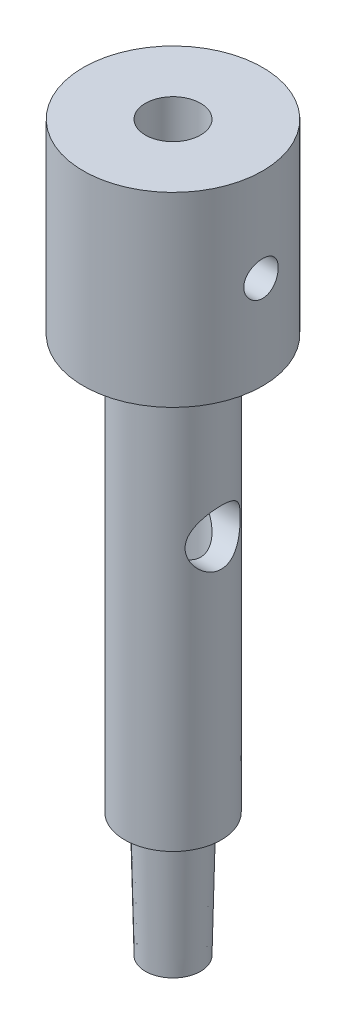
ISO-10303-21;
HEADER;
FILE_DESCRIPTION(('STEP AP214'),'2;1');
FILE_NAME('part.step','',(''),(''),'','','');
FILE_SCHEMA(('AUTOMOTIVE_DESIGN { 1 0 10303 214 1 1 1 1 }'));
ENDSEC;
DATA;
#1=APPLICATION_CONTEXT('core data for automotive mechanical design processes');
#2=APPLICATION_PROTOCOL_DEFINITION('international standard','automotive_design',2000,#1);
#3=PRODUCT_CONTEXT('',#1,'mechanical');
#4=PRODUCT('Part','Part','',(#3));
#5=PRODUCT_RELATED_PRODUCT_CATEGORY('part','',(#4));
#6=PRODUCT_DEFINITION_FORMATION('','',#4);
#7=PRODUCT_DEFINITION_CONTEXT('part definition',#1,'design');
#8=PRODUCT_DEFINITION('design','',#6,#7);
#9=PRODUCT_DEFINITION_SHAPE('','',#8);
#10=(LENGTH_UNIT() NAMED_UNIT(*) SI_UNIT(.MILLI.,.METRE.));
#11=(NAMED_UNIT(*) PLANE_ANGLE_UNIT() SI_UNIT($,.RADIAN.));
#12=(NAMED_UNIT(*) SI_UNIT($,.STERADIAN.) SOLID_ANGLE_UNIT());
#13=UNCERTAINTY_MEASURE_WITH_UNIT(LENGTH_MEASURE(1.E-05),#10,'distance_accuracy_value','');
#14=(GEOMETRIC_REPRESENTATION_CONTEXT(3) GLOBAL_UNCERTAINTY_ASSIGNED_CONTEXT((#13)) GLOBAL_UNIT_ASSIGNED_CONTEXT((#10,
#11,#12)) REPRESENTATION_CONTEXT('',''));
#15=CARTESIAN_POINT('',(0.,0.,0.));
#16=DIRECTION('',(0.,0.,1.));
#17=DIRECTION('',(1.,0.,0.));
#18=AXIS2_PLACEMENT_3D('',#15,#16,#17);
#19=CARTESIAN_POINT('',(-6.5,4.21918338413425,0.));
#20=DIRECTION('',(0.,-1.,0.));
#21=DIRECTION('',(1.,0.,0.));
#22=AXIS2_PLACEMENT_3D('',#19,#20,#21);
#23=PLANE('',#22);
#24=CARTESIAN_POINT('',(0.,4.21918338413425,0.));
#25=DIRECTION('',(0.,1.,0.));
#26=DIRECTION('',(-1.,0.,0.));
#27=AXIS2_PLACEMENT_3D('',#24,#25,#26);
#28=CIRCLE('',#27,3.5);
#29=CARTESIAN_POINT('',(-3.5,4.21918338413425,0.));
#30=VERTEX_POINT('',#29);
#31=EDGE_CURVE('E63',#30,#30,#28,.T.);
#32=ORIENTED_EDGE('',*,*,#31,.T.);
#33=EDGE_LOOP('',(#32));
#34=FACE_BOUND('',#33,.T.);
#35=CARTESIAN_POINT('',(0.,4.21918338413425,0.));
#36=DIRECTION('',(0.,1.,0.));
#37=DIRECTION('',(-1.,0.,0.));
#38=AXIS2_PLACEMENT_3D('',#35,#36,#37);
#39=CIRCLE('',#38,6.5);
#40=CARTESIAN_POINT('',(-6.5,4.21918338413425,0.));
#41=VERTEX_POINT('',#40);
#42=EDGE_CURVE('E93',#41,#41,#39,.T.);
#43=ORIENTED_EDGE('',*,*,#42,.F.);
#44=EDGE_LOOP('',(#43));
#45=FACE_BOUND('',#44,.T.);
#46=ADVANCED_FACE('F37',(#34,#45),#23,.T.);
#47=CARTESIAN_POINT('',(0.,17.7191833841343,0.));
#48=DIRECTION('',(0.,1.,0.));
#49=DIRECTION('',(-1.,0.,0.));
#50=AXIS2_PLACEMENT_3D('',#47,#48,#49);
#51=CYLINDRICAL_SURFACE('',#50,6.5);
#52=CARTESIAN_POINT('',(6.37867541108654,10.9691833841343,-1.25));
#53=CARTESIAN_POINT('',(6.37867677250476,11.0386963140044,-1.24999736885642));
#54=CARTESIAN_POINT('',(6.37982405427988,11.1082429991947,-1.24418186230501));
#55=CARTESIAN_POINT('',(6.38428311706257,11.2453729135483,-1.22109056860371));
#56=CARTESIAN_POINT('',(6.38759669482778,11.3129544641578,-1.20380526806022));
#57=CARTESIAN_POINT('',(6.39599950317928,11.4441502065155,-1.15832687331589));
#58=CARTESIAN_POINT('',(6.40108703704062,11.5077681210492,-1.13014419926354));
#59=CARTESIAN_POINT('',(6.41246250789304,11.6293696591011,-1.06369901776583));
#60=CARTESIAN_POINT('',(6.41875036130931,11.6873536744676,-1.02543721203108));
#61=CARTESIAN_POINT('',(6.43190989333671,11.7968039903531,-0.939386229111982));
#62=CARTESIAN_POINT('',(6.43878755510874,11.8481858588886,-0.891490559318431));
#63=CARTESIAN_POINT('',(6.45229899014005,11.9422371492079,-0.787761561290341));
#64=CARTESIAN_POINT('',(6.45893274695996,11.9849059846065,-0.731927699245868));
#65=CARTESIAN_POINT('',(6.47127318847283,12.0606450892631,-0.613350935538111));
#66=CARTESIAN_POINT('',(6.4769719992949,12.0936355134868,-0.550556144435078));
#67=CARTESIAN_POINT('',(6.48673338477553,12.1485665967978,-0.420187239305379));
#68=CARTESIAN_POINT('',(6.49079610096305,12.1705082116942,-0.352613539268897));
#69=CARTESIAN_POINT('',(6.49678527544986,12.2024570858871,-0.215480422586722));
#70=CARTESIAN_POINT('',(6.49873720804986,12.2126067716943,-0.14595531906255));
#71=CARTESIAN_POINT('',(6.50037275588565,12.2211276757453,-0.00616353547048027));
#72=CARTESIAN_POINT('',(6.50005657387401,12.2194999468023,0.0641030777512555));
#73=CARTESIAN_POINT('',(6.49721136164987,12.2046210028313,0.20240579014493));
#74=CARTESIAN_POINT('',(6.49471153255983,12.1915231675688,0.27045907804483));
#75=CARTESIAN_POINT('',(6.48781272689528,12.154318656978,0.40338352482685));
#76=CARTESIAN_POINT('',(6.48341367849243,12.1302115652784,0.468254563253172));
#77=CARTESIAN_POINT('',(6.47316216290495,12.0715282430622,0.593415183621928));
#78=CARTESIAN_POINT('',(6.46730128437235,12.0368911614918,0.653675517596704));
#79=CARTESIAN_POINT('',(6.45477348931643,11.9581759871645,0.767585734089794));
#80=CARTESIAN_POINT('',(6.44810648677241,11.9140968864714,0.821234909902558));
#81=CARTESIAN_POINT('',(6.43457726746675,11.81690512955,0.921309234720222));
#82=CARTESIAN_POINT('',(6.42771363640452,11.7636582670168,0.967603944931728));
#83=CARTESIAN_POINT('',(6.41466719987934,11.6500882967981,1.05062658176579));
#84=CARTESIAN_POINT('',(6.40848440543154,11.5897650746578,1.08735435361944));
#85=CARTESIAN_POINT('',(6.39749734332418,11.4635763754986,1.15024066625937));
#86=CARTESIAN_POINT('',(6.39269565900802,11.3977008065724,1.17637943730279));
#87=CARTESIAN_POINT('',(6.3850533836003,11.2623796069448,1.21718055037064));
#88=CARTESIAN_POINT('',(6.38221255780053,11.1929344045861,1.23184426594895));
#89=CARTESIAN_POINT('',(6.37886030689755,11.05362372182,1.24908687610468));
#90=CARTESIAN_POINT('',(6.37831269303332,10.9837823272923,1.25185353492831));
#91=CARTESIAN_POINT('',(6.37951191542098,10.8446357021994,1.2457275498192));
#92=CARTESIAN_POINT('',(6.38125863196178,10.77533044385,1.23683551420125));
#93=CARTESIAN_POINT('',(6.38681592650117,10.639845912538,1.20780600299423));
#94=CARTESIAN_POINT('',(6.39060829956575,10.5736445820509,1.18776767337306));
#95=CARTESIAN_POINT('',(6.39981381261965,10.445538960407,1.13711989327064));
#96=CARTESIAN_POINT('',(6.40522707742377,10.3836350006163,1.10650962868251));
#97=CARTESIAN_POINT('',(6.41714642685596,10.2650562629417,1.03515742955884));
#98=CARTESIAN_POINT('',(6.42366494996723,10.2084538769154,0.994297306141351));
#99=CARTESIAN_POINT('',(6.43702568121476,10.1028408247013,0.903763938941161));
#100=CARTESIAN_POINT('',(6.44386791999234,10.0538308790607,0.854089859644086));
#101=CARTESIAN_POINT('',(6.45722186414506,9.96408850811753,0.746498406265068));
#102=CARTESIAN_POINT('',(6.4637275444346,9.92348261810557,0.688474621768319));
#103=CARTESIAN_POINT('',(6.47557271520352,9.8525957310868,0.566319701133034));
#104=CARTESIAN_POINT('',(6.48091225217478,9.82231432243593,0.50218880861948));
#105=CARTESIAN_POINT('',(6.48979767344294,9.77312351921648,0.36998330685025));
#106=CARTESIAN_POINT('',(6.49335318520434,9.75415297881117,0.301932124206294));
#107=CARTESIAN_POINT('',(6.49831110108715,9.72792778682415,0.163534387521066));
#108=CARTESIAN_POINT('',(6.4997137440819,9.72067183543584,0.0931880890209645));
#109=CARTESIAN_POINT('',(6.50020279357526,9.71812896838799,-0.0465913760590873));
#110=CARTESIAN_POINT('',(6.49932611998711,9.72265127296917,-0.116021014310179));
#111=CARTESIAN_POINT('',(6.49543210097589,9.74311742421708,-0.253111453624555));
#112=CARTESIAN_POINT('',(6.49241477841525,9.75906114890139,-0.320772273571074));
#113=CARTESIAN_POINT('',(6.48457887372446,9.80183548032838,-0.452296774627187));
#114=CARTESIAN_POINT('',(6.47976381696689,9.82864478831026,-0.516167605689455));
#115=CARTESIAN_POINT('',(6.468852626646,9.89236594138757,-0.638532441229211));
#116=CARTESIAN_POINT('',(6.46275640135273,9.92927850992023,-0.697026060274199));
#117=CARTESIAN_POINT('',(6.44983924026474,10.0128101093001,-0.807923978838735));
#118=CARTESIAN_POINT('',(6.44300880304229,10.0595664701766,-0.860223742450047));
#119=CARTESIAN_POINT('',(6.42945166376516,10.1611744754113,-0.95630083305936));
#120=CARTESIAN_POINT('',(6.42272498654338,10.216028025461,-1.00007614816928));
#121=CARTESIAN_POINT('',(6.41006461317974,10.3329183036231,-1.07826726211679));
#122=CARTESIAN_POINT('',(6.40413935016887,10.3950202636384,-1.11258695800967));
#123=CARTESIAN_POINT('',(6.39385470831481,10.5242037710566,-1.17025077216292));
#124=CARTESIAN_POINT('',(6.38949387392551,10.591280619317,-1.19360509889594));
#125=CARTESIAN_POINT('',(6.38372654797567,10.7103125714996,-1.22401068110332));
#126=CARTESIAN_POINT('',(6.381843804222,10.7615773779336,-1.23373969739611));
#127=CARTESIAN_POINT('',(6.37931774381065,10.8649496073058,-1.24673524699077));
#128=CARTESIAN_POINT('',(6.37867439018579,10.9170570050655,-1.25000197304282));
#129=CARTESIAN_POINT('',(6.37867541108654,10.9691833841343,-1.25));
#130=B_SPLINE_CURVE_WITH_KNOTS('',3,(#52,#53,#54,#55,#56,#57,#58,#59,#60,#61,#62,#63,#64,#65,
#66,#67,#68,#69,#70,#71,#72,#73,#74,#75,#76,#77,#78,#79,#80,#81,#82,#83,#84,#85,#86,#87,#88,#89,
#90,#91,#92,#93,#94,#95,#96,#97,#98,#99,#100,#101,#102,#103,#104,#105,#106,#107,#108,#109,#110,
#111,#112,#113,#114,#115,#116,#117,#118,#119,#120,#121,#122,#123,#124,#125,#126,#127,#128,#129),
.UNSPECIFIED.,.T.,.F.,(4,2,2,2,2,2,2,2,2,2,2,2,2,2,2,2,2,2,2,2,2,2,2,2,2,2,2,2,2,2,2,2,2,2,2,2,
2,2,4),(0.,0.208347994425065,0.416869015339833,0.625191138043345,0.833498761161485,
1.04424985912792,1.25501513592546,1.46747321088402,1.67991290338878,1.88975909537704,
2.09958652891119,2.30665024511142,2.513721793133,2.72201348359888,2.93032742030891,
3.14200045966175,3.35367692313738,3.56574678669525,3.77779126179577,3.98647658946278,
4.19515102900508,4.40199833043661,4.60886156399134,4.81822954602392,5.02761738559911,
5.23995929713473,5.45229274146445,5.66346766485101,5.87461915545404,6.08237184297278,
6.29012231169613,6.49746750164925,6.70482754230236,6.91529891011171,7.12581989203801,
7.33840759539417,7.55079699078514,7.70703771468346,7.86327377833245),.UNSPECIFIED.);
#131=CARTESIAN_POINT('',(6.37867541108654,10.9691833841343,-1.25));
#132=VERTEX_POINT('',#131);
#133=EDGE_CURVE('E11',#132,#132,#130,.T.);
#134=ORIENTED_EDGE('',*,*,#133,.F.);
#135=EDGE_LOOP('',(#134));
#136=FACE_BOUND('',#135,.T.);
#137=ORIENTED_EDGE('',*,*,#42,.T.);
#138=EDGE_LOOP('',(#137));
#139=FACE_BOUND('',#138,.T.);
#140=CARTESIAN_POINT('',(0.,17.7191833841343,0.));
#141=DIRECTION('',(0.,1.,0.));
#142=DIRECTION('',(-1.,0.,0.));
#143=AXIS2_PLACEMENT_3D('',#140,#141,#142);
#144=CIRCLE('',#143,6.5);
#145=CARTESIAN_POINT('',(-6.5,17.7191833841343,0.));
#146=VERTEX_POINT('',#145);
#147=EDGE_CURVE('E90',#146,#146,#144,.T.);
#148=ORIENTED_EDGE('',*,*,#147,.F.);
#149=EDGE_LOOP('',(#148));
#150=FACE_BOUND('',#149,.T.);
#151=ADVANCED_FACE('F123',(#136,#139,#150),#51,.T.);
#152=CARTESIAN_POINT('',(-2.,17.7191833841343,0.));
#153=DIRECTION('',(0.,1.,0.));
#154=DIRECTION('',(-1.,0.,0.));
#155=AXIS2_PLACEMENT_3D('',#152,#153,#154);
#156=PLANE('',#155);
#157=ORIENTED_EDGE('',*,*,#147,.T.);
#158=EDGE_LOOP('',(#157));
#159=FACE_BOUND('',#158,.T.);
#160=CARTESIAN_POINT('',(0.,17.7191833841343,0.));
#161=DIRECTION('',(0.,1.,0.));
#162=DIRECTION('',(-1.,0.,0.));
#163=AXIS2_PLACEMENT_3D('',#160,#161,#162);
#164=CIRCLE('',#163,2.);
#165=CARTESIAN_POINT('',(-2.,17.7191833841343,0.));
#166=VERTEX_POINT('',#165);
#167=EDGE_CURVE('E87',#166,#166,#164,.T.);
#168=ORIENTED_EDGE('',*,*,#167,.F.);
#169=EDGE_LOOP('',(#168));
#170=FACE_BOUND('',#169,.T.);
#171=ADVANCED_FACE('F119',(#159,#170),#156,.T.);
#172=CARTESIAN_POINT('',(0.,17.7191833841343,0.));
#173=DIRECTION('',(0.,1.,0.));
#174=DIRECTION('',(-1.,0.,0.));
#175=AXIS2_PLACEMENT_3D('',#172,#173,#174);
#176=CYLINDRICAL_SURFACE('',#175,2.);
#177=CARTESIAN_POINT('',(1.5612494995996,10.9691833841343,-1.25));
#178=CARTESIAN_POINT('',(1.56125800072558,10.9070631023313,-1.24999462210485));
#179=CARTESIAN_POINT('',(1.56502642708837,10.844845548764,-1.24532693849665));
#180=CARTESIAN_POINT('',(1.57943717205478,10.7225070640549,-1.22698950832934));
#181=CARTESIAN_POINT('',(1.59009816464115,10.662392297769,-1.21329530430551));
#182=CARTESIAN_POINT('',(1.61650085329041,10.5464010614354,-1.1778807391187));
#183=CARTESIAN_POINT('',(1.63219837418033,10.4904927754524,-1.15622993332784));
#184=CARTESIAN_POINT('',(1.66682950714432,10.3831745224961,-1.10571945561924));
#185=CARTESIAN_POINT('',(1.68576320748676,10.3317646782777,-1.07685958706091));
#186=CARTESIAN_POINT('',(1.72779611374711,10.2273182296573,-1.00823937928364));
#187=CARTESIAN_POINT('',(1.75111338227346,10.1749886433017,-0.9675360936925));
#188=CARTESIAN_POINT('',(1.79752820854877,10.0773006849893,-0.878308664496877));
#189=CARTESIAN_POINT('',(1.82062555863329,10.0319483868503,-0.829777781297411));
#190=CARTESIAN_POINT('',(1.86729453891009,9.94407979898613,-0.719186665258489));
#191=CARTESIAN_POINT('',(1.8905872224145,9.90256571602995,-0.656200568910555));
#192=CARTESIAN_POINT('',(1.9318323169914,9.8310581793711,-0.522404070837315));
#193=CARTESIAN_POINT('',(1.94979001179838,9.801053318383,-0.451601506478241));
#194=CARTESIAN_POINT('',(1.976698413182,9.75670107352719,-0.311776878362019));
#195=CARTESIAN_POINT('',(1.98637922422038,9.74107196773732,-0.243305636047241));
#196=CARTESIAN_POINT('',(1.99850544379202,9.72155131449085,-0.104105100662263));
#197=CARTESIAN_POINT('',(2.00095845843657,9.7176474280137,-0.0333782605640266));
#198=CARTESIAN_POINT('',(1.99852909107527,9.72153907341187,0.0980658284213403));
#199=CARTESIAN_POINT('',(1.99458699811902,9.72783476043516,0.158852523273786));
#200=CARTESIAN_POINT('',(1.98145272261225,9.74905036849758,0.278306645903669));
#201=CARTESIAN_POINT('',(1.97226014325117,9.76397094137177,0.336973913146974));
#202=CARTESIAN_POINT('',(1.94938133614675,9.80178715923137,0.450889117077072));
#203=CARTESIAN_POINT('',(1.93568361673912,9.82470320818284,0.506127875493232));
#204=CARTESIAN_POINT('',(1.90485632889331,9.87765213939424,0.612019220469381));
#205=CARTESIAN_POINT('',(1.88772597874226,9.90768664302486,0.66267075856));
#206=CARTESIAN_POINT('',(1.84893224750793,9.97821154946362,0.764713515567041));
#207=CARTESIAN_POINT('',(1.82697004307144,10.0195380108766,0.815412344918949));
#208=CARTESIAN_POINT('',(1.78195462752237,10.1093157643576,0.909598595905497));
#209=CARTESIAN_POINT('',(1.75889986449171,10.1577774105808,0.953075338789631));
#210=CARTESIAN_POINT('',(1.71071442112195,10.2678890070404,1.03735445892931));
#211=CARTESIAN_POINT('',(1.68570581533195,10.3304347649846,1.07706615479946));
#212=CARTESIAN_POINT('',(1.64014139095399,10.4628295039077,1.14526153203308));
#213=CARTESIAN_POINT('',(1.6195774019168,10.5326647280897,1.17376589603358));
#214=CARTESIAN_POINT('',(1.5909187656712,10.6589527870221,1.21218566853166));
#215=CARTESIAN_POINT('',(1.58096704305272,10.7140943467719,1.22501841721721));
#216=CARTESIAN_POINT('',(1.56679138875765,10.8262985728832,1.24310168537523));
#217=CARTESIAN_POINT('',(1.56255963237428,10.8833585051742,1.24836256353275));
#218=CARTESIAN_POINT('',(1.56046133530164,10.9979120646745,1.25098535954508));
#219=CARTESIAN_POINT('',(1.56260938140435,11.0554063855001,1.24832917576576));
#220=CARTESIAN_POINT('',(1.57296042862705,11.1689639651659,1.23525733555987));
#221=CARTESIAN_POINT('',(1.58116844404657,11.2250259990972,1.22483525320262));
#222=CARTESIAN_POINT('',(1.60230060601957,11.3334017680001,1.1970493572483));
#223=CARTESIAN_POINT('',(1.61514477937171,11.3857620574658,1.17980280626788));
#224=CARTESIAN_POINT('',(1.64415573440842,11.4869707186912,1.13902451938522));
#225=CARTESIAN_POINT('',(1.66032369489908,11.5358178361587,1.11549055271421));
#226=CARTESIAN_POINT('',(1.69787203988937,11.6384894233113,1.05765376772319));
#227=CARTESIAN_POINT('',(1.7196587573829,11.6914909253836,1.0221537381422));
#228=CARTESIAN_POINT('',(1.76393958000711,11.7913684365734,0.943690263224859));
#229=CARTESIAN_POINT('',(1.78643439903354,11.8382380011122,0.900719074496597));
#230=CARTESIAN_POINT('',(1.83383164018972,11.9321666303774,0.80038065949919));
#231=CARTESIAN_POINT('',(1.85854204787597,11.9780519411419,0.74180994971416));
#232=CARTESIAN_POINT('',(1.90384248964999,12.0592520360101,0.616299987869574));
#233=CARTESIAN_POINT('',(1.92443445329132,12.0945717741079,0.549364678748658));
#234=CARTESIAN_POINT('',(1.95809255957561,12.1511783753369,0.412925900636595));
#235=CARTESIAN_POINT('',(1.9715348458918,12.173177590605,0.343814822544515));
#236=CARTESIAN_POINT('',(1.9910701008804,12.2049100528153,0.201860998884743));
#237=CARTESIAN_POINT('',(1.99717323933003,12.2146602738954,0.129023563238363));
#238=CARTESIAN_POINT('',(2.00096685748559,12.220729904173,-0.00659907199681549));
#239=CARTESIAN_POINT('',(1.99976600623617,12.2188191609212,-0.0692812975954773));
#240=CARTESIAN_POINT('',(1.99160739958772,12.2057217091599,-0.193279811091728));
#241=CARTESIAN_POINT('',(1.98464990541518,12.1945354215585,-0.254596160840745));
#242=CARTESIAN_POINT('',(1.9659610468898,12.1640229092577,-0.372043294685528));
#243=CARTESIAN_POINT('',(1.95440367471701,12.144992544261,-0.428280180678311));
#244=CARTESIAN_POINT('',(1.92744968677265,12.0996234559702,-0.536714369111317));
#245=CARTESIAN_POINT('',(1.91205242331405,12.0732834996587,-0.588910988118241));
#246=CARTESIAN_POINT('',(1.87675342239824,12.011022805143,-0.693656737470668));
#247=CARTESIAN_POINT('',(1.85655002466956,11.9743914028153,-0.745680127162213));
#248=CARTESIAN_POINT('',(1.81433640456237,11.8941067538015,-0.843216608355415));
#249=CARTESIAN_POINT('',(1.7923241573062,11.8504455838883,-0.888722243055231));
#250=CARTESIAN_POINT('',(1.74500415099524,11.750067121831,-0.978723601300806));
#251=CARTESIAN_POINT('',(1.71967871446313,11.6923750389573,-1.02212829873816));
#252=CARTESIAN_POINT('',(1.67174821497036,11.5695387181241,-1.09877325005744));
#253=CARTESIAN_POINT('',(1.64914165167051,11.5043986292267,-1.132019125571));
#254=CARTESIAN_POINT('',(1.61429776080214,11.3827806162046,-1.18099110923231));
#255=CARTESIAN_POINT('',(1.60087340349652,11.3275477032549,-1.19896216276381));
#256=CARTESIAN_POINT('',(1.57939158437939,11.2142141061771,-1.22712822180407));
#257=CARTESIAN_POINT('',(1.57131714400176,11.1561231291101,-1.23734784245404));
#258=CARTESIAN_POINT('',(1.56476456389394,11.0761528602714,-1.24559906183097));
#259=CARTESIAN_POINT('',(1.56345069546827,11.0548192386173,-1.24724671259581));
#260=CARTESIAN_POINT('',(1.56169158695047,11.0120554176128,-1.24944824734288));
#261=CARTESIAN_POINT('',(1.56124656529967,10.9906251953326,-1.25000185626673));
#262=CARTESIAN_POINT('',(1.5612494995996,10.9691833841343,-1.25));
#263=B_SPLINE_CURVE_WITH_KNOTS('',3,(#177,#178,#179,#180,#181,#182,#183,#184,#185,#186,#187,
#188,#189,#190,#191,#192,#193,#194,#195,#196,#197,#198,#199,#200,#201,#202,#203,#204,#205,#206,
#207,#208,#209,#210,#211,#212,#213,#214,#215,#216,#217,#218,#219,#220,#221,#222,#223,#224,#225,
#226,#227,#228,#229,#230,#231,#232,#233,#234,#235,#236,#237,#238,#239,#240,#241,#242,#243,#244,
#245,#246,#247,#248,#249,#250,#251,#252,#253,#254,#255,#256,#257,#258,#259,#260,#261,#262),
.UNSPECIFIED.,.T.,.F.,(4,2,2,2,2,2,2,2,2,2,2,2,2,2,2,2,2,2,2,2,2,2,2,2,2,2,2,2,2,2,2,2,2,2,2,2,
2,2,2,2,2,2,4),(0.,0.186262444012013,0.373031654397095,0.558205556130405,0.743384509377749,
0.953406207440072,1.16360970997911,1.39917236034456,1.6345009273926,1.84590412815398,
2.05708478092387,2.23992319583511,2.42277543076413,2.60609774825956,2.78946186128171,
2.99564504832107,3.20213044016185,3.4355806792082,3.66859805095277,3.84032775480267,
4.01182230007289,4.18370925240738,4.3557385916008,4.52493212343598,4.69418576487135,
4.89566333610128,5.09735098485253,5.33136598660888,5.56527109061625,5.78520080494548,
6.0048254125896,6.19203601525123,6.37923812308582,6.55994569114422,6.74068376037879,
6.94018144108744,7.13990556958867,7.36841817421248,7.59680409585385,7.77496902270411,
7.95256577963384,8.01684109069496,8.08113255947021),.UNSPECIFIED.);
#264=CARTESIAN_POINT('',(1.5612494995996,10.9691833841343,-1.25));
#265=VERTEX_POINT('',#264);
#266=EDGE_CURVE('E59',#265,#265,#263,.T.);
#267=ORIENTED_EDGE('',*,*,#266,.F.);
#268=EDGE_LOOP('',(#267));
#269=FACE_BOUND('',#268,.T.);
#270=CARTESIAN_POINT('',(0.,-6.78081661586574,0.));
#271=DIRECTION('',(0.707106781186547,0.707106781186548,0.));
#272=DIRECTION('',(-0.707106781186548,0.707106781186547,0.));
#273=AXIS2_PLACEMENT_3D('',#270,#271,#272);
#274=ELLIPSE('',#273,2.82842712474619,2.);
#275=CARTESIAN_POINT('',(0.,-6.78081661586574,-2.));
#276=VERTEX_POINT('',#275);
#277=CARTESIAN_POINT('',(0.,-6.78081661586574,2.));
#278=VERTEX_POINT('',#277);
#279=EDGE_CURVE('E53',#276,#278,#274,.F.);
#280=ORIENTED_EDGE('',*,*,#279,.F.);
#281=CARTESIAN_POINT('',(0.,-6.78081661586574,0.));
#282=DIRECTION('',(-0.707106781186548,0.707106781186547,0.));
#283=DIRECTION('',(0.707106781186547,0.707106781186548,0.));
#284=AXIS2_PLACEMENT_3D('',#281,#282,#283);
#285=ELLIPSE('',#284,2.82842712474619,2.);
#286=EDGE_CURVE('E55',#278,#276,#285,.T.);
#287=ORIENTED_EDGE('',*,*,#286,.F.);
#288=EDGE_LOOP('',(#280,#287));
#289=FACE_BOUND('',#288,.T.);
#290=ORIENTED_EDGE('',*,*,#167,.T.);
#291=EDGE_LOOP('',(#290));
#292=FACE_BOUND('',#291,.T.);
#293=CARTESIAN_POINT('',(0.,-18.7808166158657,0.));
#294=DIRECTION('',(0.,1.,0.));
#295=DIRECTION('',(-1.,0.,0.));
#296=AXIS2_PLACEMENT_3D('',#293,#294,#295);
#297=CIRCLE('',#296,2.);
#298=CARTESIAN_POINT('',(-2.,-18.7808166158657,0.));
#299=VERTEX_POINT('',#298);
#300=EDGE_CURVE('E84',#299,#299,#297,.T.);
#301=ORIENTED_EDGE('',*,*,#300,.F.);
#302=EDGE_LOOP('',(#301));
#303=FACE_BOUND('',#302,.T.);
#304=ADVANCED_FACE('F61',(#269,#289,#292,#303),#176,.F.);
#305=CARTESIAN_POINT('',(0.,-19.2314620801364,0.));
#306=DIRECTION('',(0.,1.,0.));
#307=DIRECTION('',(-1.,0.,0.));
#308=AXIS2_PLACEMENT_3D('',#305,#306,#307);
#309=CONICAL_SURFACE('',#308,1.25,1.02974425867665);
#310=ORIENTED_EDGE('',*,*,#300,.T.);
#311=EDGE_LOOP('',(#310));
#312=FACE_BOUND('',#311,.T.);
#313=CARTESIAN_POINT('',(0.,-19.2314620801364,0.));
#314=DIRECTION('',(0.,1.,0.));
#315=DIRECTION('',(-1.,0.,0.));
#316=AXIS2_PLACEMENT_3D('',#313,#314,#315);
#317=CIRCLE('',#316,1.25);
#318=CARTESIAN_POINT('',(-1.25,-19.2314620801364,0.));
#319=VERTEX_POINT('',#318);
#320=EDGE_CURVE('E81',#319,#319,#317,.T.);
#321=ORIENTED_EDGE('',*,*,#320,.F.);
#322=EDGE_LOOP('',(#321));
#323=FACE_BOUND('',#322,.T.);
#324=ADVANCED_FACE('F118',(#312,#323),#309,.F.);
#325=CARTESIAN_POINT('',(0.,17.7191833841343,0.));
#326=DIRECTION('',(0.,1.,0.));
#327=DIRECTION('',(-1.,0.,0.));
#328=AXIS2_PLACEMENT_3D('',#325,#326,#327);
#329=CYLINDRICAL_SURFACE('',#328,1.25);
#330=ORIENTED_EDGE('',*,*,#320,.T.);
#331=EDGE_LOOP('',(#330));
#332=FACE_BOUND('',#331,.T.);
#333=CARTESIAN_POINT('',(0.,-34.7808166158657,0.));
#334=DIRECTION('',(0.,1.,0.));
#335=DIRECTION('',(-1.,0.,0.));
#336=AXIS2_PLACEMENT_3D('',#333,#334,#335);
#337=CIRCLE('',#336,1.25);
#338=CARTESIAN_POINT('',(-1.25,-34.7808166158657,0.));
#339=VERTEX_POINT('',#338);
#340=EDGE_CURVE('E78',#339,#339,#337,.T.);
#341=ORIENTED_EDGE('',*,*,#340,.F.);
#342=EDGE_LOOP('',(#341));
#343=FACE_BOUND('',#342,.T.);
#344=ADVANCED_FACE('F144',(#332,#343),#329,.F.);
#345=CARTESIAN_POINT('',(-1.99999999999999,-34.7808166158657,0.));
#346=DIRECTION('',(0.,-1.,0.));
#347=DIRECTION('',(1.,0.,0.));
#348=AXIS2_PLACEMENT_3D('',#345,#346,#347);
#349=PLANE('',#348);
#350=ORIENTED_EDGE('',*,*,#340,.T.);
#351=EDGE_LOOP('',(#350));
#352=FACE_BOUND('',#351,.T.);
#353=CARTESIAN_POINT('',(0.,-34.7808166158657,0.));
#354=DIRECTION('',(0.,1.,0.));
#355=DIRECTION('',(-1.,0.,0.));
#356=AXIS2_PLACEMENT_3D('',#353,#354,#355);
#357=CIRCLE('',#356,2.);
#358=CARTESIAN_POINT('',(-1.99999999999999,-34.7808166158657,0.));
#359=VERTEX_POINT('',#358);
#360=EDGE_CURVE('E75',#359,#359,#357,.T.);
#361=ORIENTED_EDGE('',*,*,#360,.F.);
#362=EDGE_LOOP('',(#361));
#363=FACE_BOUND('',#362,.T.);
#364=ADVANCED_FACE('F149',(#352,#363),#349,.T.);
#365=CARTESIAN_POINT('',(0.,-25.7808166158657,0.));
#366=DIRECTION('',(0.,1.,0.));
#367=DIRECTION('',(-1.,0.,0.));
#368=AXIS2_PLACEMENT_3D('',#365,#366,#367);
#369=CONICAL_SURFACE('',#368,2.2,0.0222185653267191);
#370=ORIENTED_EDGE('',*,*,#360,.T.);
#371=EDGE_LOOP('',(#370));
#372=FACE_BOUND('',#371,.T.);
#373=CARTESIAN_POINT('',(0.,-25.7808166158657,0.));
#374=DIRECTION('',(0.,1.,0.));
#375=DIRECTION('',(-1.,0.,0.));
#376=AXIS2_PLACEMENT_3D('',#373,#374,#375);
#377=CIRCLE('',#376,2.2);
#378=CARTESIAN_POINT('',(-2.19999999999999,-25.7808166158657,0.));
#379=VERTEX_POINT('',#378);
#380=EDGE_CURVE('E72',#379,#379,#377,.T.);
#381=ORIENTED_EDGE('',*,*,#380,.F.);
#382=EDGE_LOOP('',(#381));
#383=FACE_BOUND('',#382,.T.);
#384=ADVANCED_FACE('F154',(#372,#383),#369,.T.);
#385=CARTESIAN_POINT('',(-3.49999999999999,-25.7808166158657,0.));
#386=DIRECTION('',(0.,-1.,0.));
#387=DIRECTION('',(1.,0.,0.));
#388=AXIS2_PLACEMENT_3D('',#385,#386,#387);
#389=PLANE('',#388);
#390=ORIENTED_EDGE('',*,*,#380,.T.);
#391=EDGE_LOOP('',(#390));
#392=FACE_BOUND('',#391,.T.);
#393=CARTESIAN_POINT('',(0.,-25.7808166158657,0.));
#394=DIRECTION('',(0.,1.,0.));
#395=DIRECTION('',(-1.,0.,0.));
#396=AXIS2_PLACEMENT_3D('',#393,#394,#395);
#397=CIRCLE('',#396,3.5);
#398=CARTESIAN_POINT('',(-3.49999999999999,-25.7808166158657,0.));
#399=VERTEX_POINT('',#398);
#400=EDGE_CURVE('E66',#399,#399,#397,.T.);
#401=ORIENTED_EDGE('',*,*,#400,.F.);
#402=EDGE_LOOP('',(#401));
#403=FACE_BOUND('',#402,.T.);
#404=ADVANCED_FACE('F160',(#392,#403),#389,.T.);
#405=CARTESIAN_POINT('',(0.,17.7191833841343,0.));
#406=DIRECTION('',(0.,1.,0.));
#407=DIRECTION('',(-1.,0.,0.));
#408=AXIS2_PLACEMENT_3D('',#405,#406,#407);
#409=CYLINDRICAL_SURFACE('',#408,3.5);
#410=CARTESIAN_POINT('',(3.5,-4.78081661586574,0.));
#411=CARTESIAN_POINT('',(3.49999553497163,-4.78082158861361,0.103121073276095));
#412=CARTESIAN_POINT('',(3.49539218804253,-4.78884716218021,0.206418292241573));
#413=CARTESIAN_POINT('',(3.47741964792396,-4.82055823357031,0.409938220573779));
#414=CARTESIAN_POINT('',(3.46402785992758,-4.84428409766619,0.510152306170787));
#415=CARTESIAN_POINT('',(3.42984640883029,-4.9061154138002,0.704136692781991));
#416=CARTESIAN_POINT('',(3.40909195395481,-4.94415248131566,0.797935169936749));
#417=CARTESIAN_POINT('',(3.36199330055899,-5.03312648156271,0.977566018148808));
#418=CARTESIAN_POINT('',(3.33565065986803,-5.0840598199403,1.06340059975113));
#419=CARTESIAN_POINT('',(3.27741428654612,-5.20150241331863,1.23168334606477));
#420=CARTESIAN_POINT('',(3.24525701136939,-5.26887108896568,1.31343890348909));
#421=CARTESIAN_POINT('',(3.17964476042357,-5.41537395772946,1.46516457042853));
#422=CARTESIAN_POINT('',(3.1461882973923,-5.49452194748941,1.53512065191323));
#423=CARTESIAN_POINT('',(3.07747838735579,-5.67251303509549,1.66894420512512));
#424=CARTESIAN_POINT('',(3.04242478885631,-5.77256174371605,1.73132377325174));
#425=CARTESIAN_POINT('',(2.9791301999857,-5.98376688796126,1.83811251873574));
#426=CARTESIAN_POINT('',(2.9508789226201,-6.09490618687506,1.88254890095162));
#427=CARTESIAN_POINT('',(2.9109223878371,-6.29996178021793,1.94359344806483));
#428=CARTESIAN_POINT('',(2.89693925602987,-6.39224813004067,1.96418339921187));
#429=CARTESIAN_POINT('',(2.87781339076579,-6.57966635155908,1.99210676207498));
#430=CARTESIAN_POINT('',(2.87266118113285,-6.67479506150273,1.99945438414142));
#431=CARTESIAN_POINT('',(2.87194187276705,-6.86529130117448,2.00048758468052));
#432=CARTESIAN_POINT('',(2.87638786414303,-6.96065897965227,1.99415450528781));
#433=CARTESIAN_POINT('',(2.89422946937727,-7.14871912105248,1.96816496378146));
#434=CARTESIAN_POINT('',(2.90763124084925,-7.24140969753867,1.94849933463808));
#435=CARTESIAN_POINT('',(2.94153701353578,-7.42148154618518,1.8969175277205));
#436=CARTESIAN_POINT('',(2.9620133688412,-7.50888195136476,1.86504898450024));
#437=CARTESIAN_POINT('',(3.00785886649625,-7.67736646854346,1.79016995537344));
#438=CARTESIAN_POINT('',(3.03322987990245,-7.75844814842093,1.74715520649775));
#439=CARTESIAN_POINT('',(3.09092813712121,-7.92578951123545,1.64323768381765));
#440=CARTESIAN_POINT('',(3.12371858601076,-8.01079675759387,1.5805729697491));
#441=CARTESIAN_POINT('',(3.18971935679179,-8.16990093536717,1.44275323922578));
#442=CARTESIAN_POINT('',(3.22293001410095,-8.24398846425769,1.36758757586109));
#443=CARTESIAN_POINT('',(3.29050445602272,-8.3876408172791,1.19664071603844));
#444=CARTESIAN_POINT('',(3.32456879734035,-8.45572956698371,1.0994865853507));
#445=CARTESIAN_POINT('',(3.38586602556589,-8.57432340732088,0.893015490655645));
#446=CARTESIAN_POINT('',(3.41310321475137,-8.62483957951715,0.783706249477135));
#447=CARTESIAN_POINT('',(3.45598032097164,-8.70300054009167,0.563793778179169));
#448=CARTESIAN_POINT('',(3.47229170031822,-8.73198482648093,0.453802193453647));
#449=CARTESIAN_POINT('',(3.49427902499676,-8.77085477474452,0.229493069556977));
#450=CARTESIAN_POINT('',(3.49996545850226,-8.78075927109915,0.115179910205494));
#451=CARTESIAN_POINT('',(3.50003013582767,-8.78086662699959,-0.0995234593134442));
#452=CARTESIAN_POINT('',(3.49569611836472,-8.77331308205001,-0.199920938989512));
#453=CARTESIAN_POINT('',(3.47874174583056,-8.74341604247061,-0.397754958971081));
#454=CARTESIAN_POINT('',(3.46612124870397,-8.72107229429184,-0.495191448486276));
#455=CARTESIAN_POINT('',(3.43391644887746,-8.66293197739866,-0.683570804723375));
#456=CARTESIAN_POINT('',(3.41440488141579,-8.62727570592478,-0.774570013012139));
#457=CARTESIAN_POINT('',(3.36999496877883,-8.54380087981862,-0.949355356164682));
#458=CARTESIAN_POINT('',(3.34509532684397,-8.49597939687118,-1.03313974782513));
#459=CARTESIAN_POINT('',(3.28897467991618,-8.38392277500787,-1.20050997117732));
#460=CARTESIAN_POINT('',(3.25736546620182,-8.31849727770305,-1.28316737085611));
#461=CARTESIAN_POINT('',(3.19250590835506,-8.17585495474295,-1.43697220197863));
#462=CARTESIAN_POINT('',(3.15925371640031,-8.09862463832479,-1.50810627029584));
#463=CARTESIAN_POINT('',(3.09042173562361,-7.92441409205698,-1.64492727997191));
#464=CARTESIAN_POINT('',(3.05499597284182,-7.82619181727355,-1.70912186715334));
#465=CARTESIAN_POINT('',(2.99031347421968,-7.61846198445036,-1.8199337629672));
#466=CARTESIAN_POINT('',(2.96104856289278,-7.50896967296828,-1.86657443137411));
#467=CARTESIAN_POINT('',(2.91851233429598,-7.30558135185705,-1.93222109228879));
#468=CARTESIAN_POINT('',(2.90316105554951,-7.21334012483396,-1.95499953445203));
#469=CARTESIAN_POINT('',(2.88119032331329,-7.02558252352248,-1.98724336712396));
#470=CARTESIAN_POINT('',(2.87456093476639,-6.93007000306998,-1.99672390601701));
#471=CARTESIAN_POINT('',(2.87099312033822,-6.73829384599882,-2.00185191685029));
#472=CARTESIAN_POINT('',(2.87407420528575,-6.64202908531997,-1.99747153858607));
#473=CARTESIAN_POINT('',(2.8895014010665,-6.45183946517338,-1.97508383758896));
#474=CARTESIAN_POINT('',(2.90185337180125,-6.35791612447169,-1.95706789608755));
#475=CARTESIAN_POINT('',(2.93383807739166,-6.17644098283218,-1.90877044170586));
#476=CARTESIAN_POINT('',(2.95334114102881,-6.08880705761656,-1.87870654392502));
#477=CARTESIAN_POINT('',(2.99749553285304,-5.91961752012216,-1.80742189721671));
#478=CARTESIAN_POINT('',(3.02214875873851,-5.83806416344417,-1.76619703410721));
#479=CARTESIAN_POINT('',(3.07843523089261,-5.66997328292264,-1.66643167949609));
#480=CARTESIAN_POINT('',(3.11055873295866,-5.58460203540698,-1.60620233461966));
#481=CARTESIAN_POINT('',(3.17562734730331,-5.4243589821438,-1.47338604433882));
#482=CARTESIAN_POINT('',(3.20857315102009,-5.34949638876166,-1.40078837818174));
#483=CARTESIAN_POINT('',(3.27641810201075,-5.20295589274483,-1.23454792336607));
#484=CARTESIAN_POINT('',(3.3110499554466,-5.1328342336629,-1.13941038595582));
#485=CARTESIAN_POINT('',(3.37399623220539,-5.00975782723457,-0.936681498761443));
#486=CARTESIAN_POINT('',(3.4023141898287,-4.95679346826722,-0.829097167751358));
#487=CARTESIAN_POINT('',(3.44515268687731,-4.87819947173287,-0.624382501194151));
#488=CARTESIAN_POINT('',(3.46123111271098,-4.84938426488352,-0.528793868969385));
#489=CARTESIAN_POINT('',(3.48544612424225,-4.80631443278588,-0.333572465521447));
#490=CARTESIAN_POINT('',(3.49360564902775,-4.79201774538254,-0.233952251382033));
#491=CARTESIAN_POINT('',(3.49829363663156,-4.78380443944391,-0.111553482810459));
#492=CARTESIAN_POINT('',(3.49893257713489,-4.78268508574083,-0.0892655426398969));
#493=CARTESIAN_POINT('',(3.49978626453079,-4.7811905964796,-0.0446544907868009));
#494=CARTESIAN_POINT('',(3.50000096692386,-4.78081553899273,-0.0223313756604227));
#495=CARTESIAN_POINT('',(3.5,-4.78081661586574,0.));
#496=B_SPLINE_CURVE_WITH_KNOTS('',3,(#410,#411,#412,#413,#414,#415,#416,#417,#418,#419,#420,
#421,#422,#423,#424,#425,#426,#427,#428,#429,#430,#431,#432,#433,#434,#435,#436,#437,#438,#439,
#440,#441,#442,#443,#444,#445,#446,#447,#448,#449,#450,#451,#452,#453,#454,#455,#456,#457,#458,
#459,#460,#461,#462,#463,#464,#465,#466,#467,#468,#469,#470,#471,#472,#473,#474,#475,#476,#477,
#478,#479,#480,#481,#482,#483,#484,#485,#486,#487,#488,#489,#490,#491,#492,#493,#494,#495),
.UNSPECIFIED.,.T.,.F.,(4,2,2,2,2,2,2,2,2,2,2,2,2,2,2,2,2,2,2,2,2,2,2,2,2,2,2,2,2,2,2,2,2,2,2,2,
2,2,2,2,2,2,4),(0.,0.309268603260588,0.61933545790836,0.9279391304917,1.23645688582088,
1.56726264134176,1.89845895106408,2.2656484043951,2.63227902790326,2.91779157032785,
3.2029975462506,3.48859273422686,3.77438448762791,4.05907183070886,4.34386821620899,
4.67430361887065,5.00502190433096,5.37340568410987,5.74155673192308,6.08426181113763,
6.42662841774189,6.72747548140296,7.028327702629,7.32609492686909,7.62393389525625,
7.95277463151787,8.28199402221958,8.64793130772769,9.01337988790352,9.30087929443284,
9.58805092761004,9.87579992974731,10.1637309643623,10.4466801504154,10.7297337802306,
11.0563737137124,11.3832982298872,11.7509152703937,12.1183260120783,12.4204193511693,
12.7216349655948,12.7886015789519,12.85557521625),.UNSPECIFIED.);
#497=CARTESIAN_POINT('',(3.5,-4.78081661586574,0.));
#498=VERTEX_POINT('',#497);
#499=EDGE_CURVE('E47',#498,#498,#496,.T.);
#500=ORIENTED_EDGE('',*,*,#499,.F.);
#501=EDGE_LOOP('',(#500));
#502=FACE_BOUND('',#501,.T.);
#503=ORIENTED_EDGE('',*,*,#400,.T.);
#504=EDGE_LOOP('',(#503));
#505=FACE_BOUND('',#504,.T.);
#506=ORIENTED_EDGE('',*,*,#31,.F.);
#507=EDGE_LOOP('',(#506));
#508=FACE_BOUND('',#507,.T.);
#509=ADVANCED_FACE('F100',(#502,#505,#508),#409,.T.);
#510=CARTESIAN_POINT('',(0.,-6.78081661586574,0.));
#511=DIRECTION('',(1.,0.,0.));
#512=DIRECTION('',(0.,1.,0.));
#513=AXIS2_PLACEMENT_3D('',#510,#511,#512);
#514=CYLINDRICAL_SURFACE('',#513,2.);
#515=ORIENTED_EDGE('',*,*,#279,.T.);
#516=ORIENTED_EDGE('',*,*,#286,.T.);
#517=EDGE_LOOP('',(#515,#516));
#518=FACE_BOUND('',#517,.T.);
#519=ORIENTED_EDGE('',*,*,#499,.T.);
#520=EDGE_LOOP('',(#519));
#521=FACE_BOUND('',#520,.T.);
#522=ADVANCED_FACE('F56',(#518,#521),#514,.F.);
#523=CARTESIAN_POINT('',(6.5,10.9691833841343,0.));
#524=DIRECTION('',(1.,0.,0.));
#525=DIRECTION('',(0.,0.,-1.));
#526=AXIS2_PLACEMENT_3D('',#523,#524,#525);
#527=CYLINDRICAL_SURFACE('',#526,1.25);
#528=ORIENTED_EDGE('',*,*,#266,.T.);
#529=EDGE_LOOP('',(#528));
#530=FACE_BOUND('',#529,.T.);
#531=ORIENTED_EDGE('',*,*,#133,.T.);
#532=EDGE_LOOP('',(#531));
#533=FACE_BOUND('',#532,.T.);
#534=ADVANCED_FACE('F105',(#530,#533),#527,.F.);
#535=CLOSED_SHELL('',(#46,#151,#171,#304,#324,#344,#364,#384,#404,#509,#522,#534));
#536=MANIFOLD_SOLID_BREP('B2',#535);
#537=ADVANCED_BREP_SHAPE_REPRESENTATION('',(#18,#536),#14);
#538=SHAPE_DEFINITION_REPRESENTATION(#9,#537);
ENDSEC;
END-ISO-10303-21;
